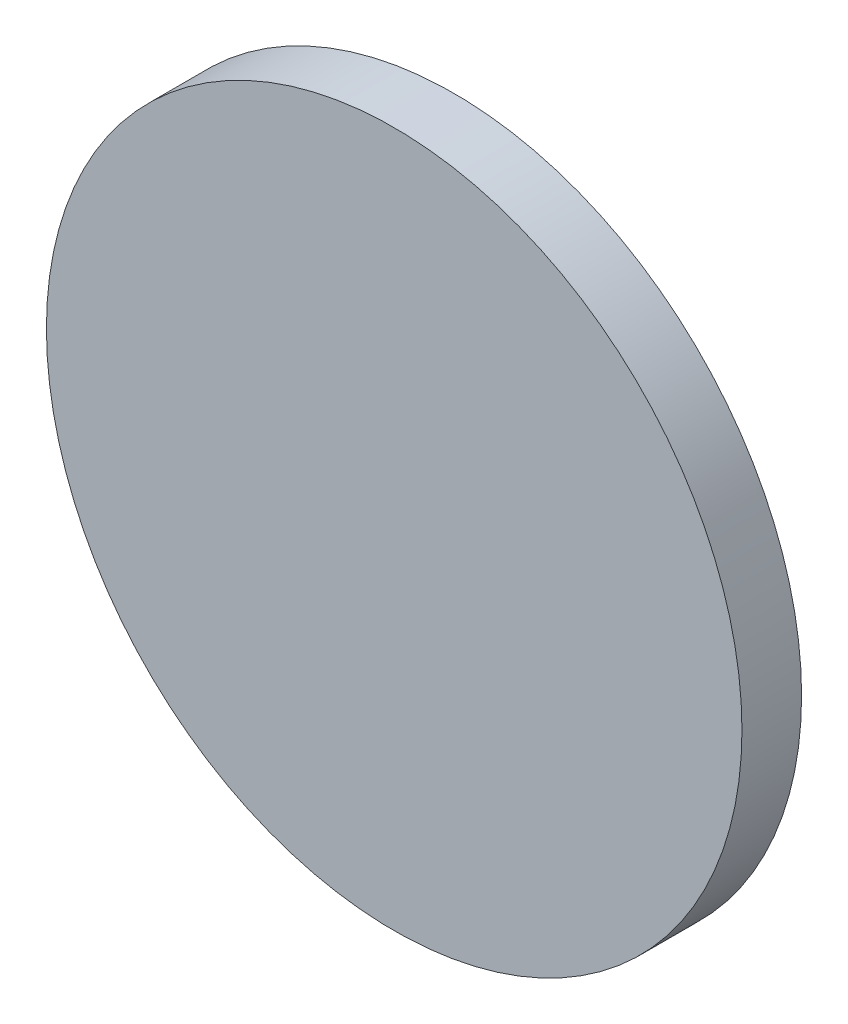
ISO-10303-21;
HEADER;
FILE_DESCRIPTION(('STEP AP214'),'2;1');
FILE_NAME('part.step','',(''),(''),'','','');
FILE_SCHEMA(('AUTOMOTIVE_DESIGN { 1 0 10303 214 1 1 1 1 }'));
ENDSEC;
DATA;
#1=APPLICATION_CONTEXT('core data for automotive mechanical design processes');
#2=APPLICATION_PROTOCOL_DEFINITION('international standard','automotive_design',2000,#1);
#3=PRODUCT_CONTEXT('',#1,'mechanical');
#4=PRODUCT('Part','Part','',(#3));
#5=PRODUCT_RELATED_PRODUCT_CATEGORY('part','',(#4));
#6=PRODUCT_DEFINITION_FORMATION('','',#4);
#7=PRODUCT_DEFINITION_CONTEXT('part definition',#1,'design');
#8=PRODUCT_DEFINITION('design','',#6,#7);
#9=PRODUCT_DEFINITION_SHAPE('','',#8);
#10=(LENGTH_UNIT() NAMED_UNIT(*) SI_UNIT(.MILLI.,.METRE.));
#11=(NAMED_UNIT(*) PLANE_ANGLE_UNIT() SI_UNIT($,.RADIAN.));
#12=(NAMED_UNIT(*) SI_UNIT($,.STERADIAN.) SOLID_ANGLE_UNIT());
#13=UNCERTAINTY_MEASURE_WITH_UNIT(LENGTH_MEASURE(1.E-05),#10,'distance_accuracy_value','');
#14=(GEOMETRIC_REPRESENTATION_CONTEXT(3) GLOBAL_UNCERTAINTY_ASSIGNED_CONTEXT((#13)) GLOBAL_UNIT_ASSIGNED_CONTEXT((#10,
#11,#12)) REPRESENTATION_CONTEXT('',''));
#15=CARTESIAN_POINT('',(0.,0.,0.));
#16=DIRECTION('',(0.,0.,1.));
#17=DIRECTION('',(1.,0.,0.));
#18=AXIS2_PLACEMENT_3D('',#15,#16,#17);
#19=CARTESIAN_POINT('',(10.9013,5.849620014875,0.));
#20=DIRECTION('',(0.,0.,-1.));
#21=DIRECTION('',(-1.,0.,0.));
#22=AXIS2_PLACEMENT_3D('',#19,#20,#21);
#23=PLANE('',#22);
#24=CARTESIAN_POINT('',(10.9013,5.849620014875,0.));
#25=DIRECTION('',(0.,0.,1.));
#26=DIRECTION('',(1.,0.,0.));
#27=AXIS2_PLACEMENT_3D('',#24,#25,#26);
#28=CIRCLE('',#27,0.200024667);
#29=CARTESIAN_POINT('',(11.101324667,5.849620014875,0.));
#30=VERTEX_POINT('',#29);
#31=EDGE_CURVE('E18',#30,#30,#28,.T.);
#32=ORIENTED_EDGE('',*,*,#31,.F.);
#33=EDGE_LOOP('',(#32));
#34=FACE_BOUND('',#33,.T.);
#35=ADVANCED_FACE('F15',(#34),#23,.T.);
#36=CARTESIAN_POINT('',(10.9013,5.849620014875,0.));
#37=DIRECTION('',(0.,0.,1.));
#38=DIRECTION('',(1.,0.,0.));
#39=AXIS2_PLACEMENT_3D('',#36,#37,#38);
#40=CYLINDRICAL_SURFACE('',#39,0.200024667);
#41=CARTESIAN_POINT('',(10.9013,5.849620014875,0.03429));
#42=DIRECTION('',(0.,0.,1.));
#43=DIRECTION('',(1.,0.,0.));
#44=AXIS2_PLACEMENT_3D('',#41,#42,#43);
#45=CIRCLE('',#44,0.200024667);
#46=CARTESIAN_POINT('',(11.101324667,5.849620014875,0.03429));
#47=VERTEX_POINT('',#46);
#48=EDGE_CURVE('E10',#47,#47,#45,.T.);
#49=ORIENTED_EDGE('',*,*,#48,.F.);
#50=EDGE_LOOP('',(#49));
#51=FACE_BOUND('',#50,.T.);
#52=ORIENTED_EDGE('',*,*,#31,.T.);
#53=EDGE_LOOP('',(#52));
#54=FACE_BOUND('',#53,.T.);
#55=ADVANCED_FACE('F27',(#51,#54),#40,.T.);
#56=CARTESIAN_POINT('',(10.9013,5.849620014875,0.03429));
#57=DIRECTION('',(0.,0.,1.));
#58=DIRECTION('',(1.,0.,0.));
#59=AXIS2_PLACEMENT_3D('',#56,#57,#58);
#60=PLANE('',#59);
#61=ORIENTED_EDGE('',*,*,#48,.T.);
#62=EDGE_LOOP('',(#61));
#63=FACE_BOUND('',#62,.T.);
#64=ADVANCED_FACE('F34',(#63),#60,.T.);
#65=CLOSED_SHELL('',(#35,#55,#64));
#66=MANIFOLD_SOLID_BREP('B1',#65);
#67=ADVANCED_BREP_SHAPE_REPRESENTATION('',(#18,#66),#14);
#68=SHAPE_DEFINITION_REPRESENTATION(#9,#67);
ENDSEC;
END-ISO-10303-21;
